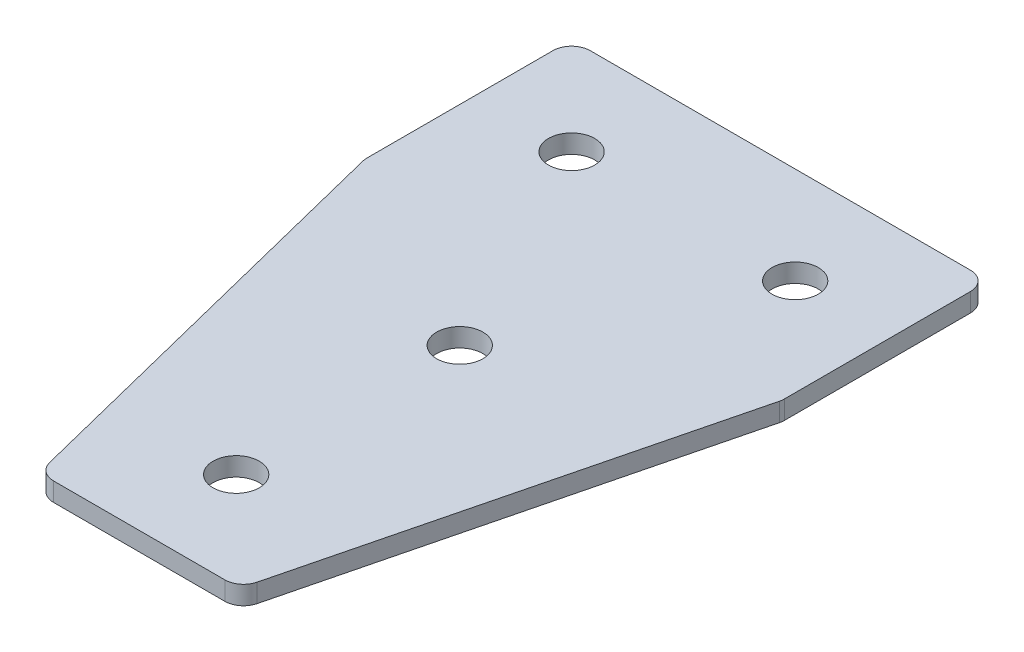
ISO-10303-21;
HEADER;
FILE_DESCRIPTION(('STEP AP214'),'2;1');
FILE_NAME('part.step','',(''),(''),'','','');
FILE_SCHEMA(('AUTOMOTIVE_DESIGN { 1 0 10303 214 1 1 1 1 }'));
ENDSEC;
DATA;
#1=APPLICATION_CONTEXT('core data for automotive mechanical design processes');
#2=APPLICATION_PROTOCOL_DEFINITION('international standard','automotive_design',2000,#1);
#3=PRODUCT_CONTEXT('',#1,'mechanical');
#4=PRODUCT('Part','Part','',(#3));
#5=PRODUCT_RELATED_PRODUCT_CATEGORY('part','',(#4));
#6=PRODUCT_DEFINITION_FORMATION('','',#4);
#7=PRODUCT_DEFINITION_CONTEXT('part definition',#1,'design');
#8=PRODUCT_DEFINITION('design','',#6,#7);
#9=PRODUCT_DEFINITION_SHAPE('','',#8);
#10=(LENGTH_UNIT() NAMED_UNIT(*) SI_UNIT(.MILLI.,.METRE.));
#11=(NAMED_UNIT(*) PLANE_ANGLE_UNIT() SI_UNIT($,.RADIAN.));
#12=(NAMED_UNIT(*) SI_UNIT($,.STERADIAN.) SOLID_ANGLE_UNIT());
#13=UNCERTAINTY_MEASURE_WITH_UNIT(LENGTH_MEASURE(1.E-05),#10,'distance_accuracy_value','');
#14=(GEOMETRIC_REPRESENTATION_CONTEXT(3) GLOBAL_UNCERTAINTY_ASSIGNED_CONTEXT((#13)) GLOBAL_UNIT_ASSIGNED_CONTEXT((#10,
#11,#12)) REPRESENTATION_CONTEXT('',''));
#15=CARTESIAN_POINT('',(0.,0.,0.));
#16=DIRECTION('',(0.,0.,1.));
#17=DIRECTION('',(1.,0.,0.));
#18=AXIS2_PLACEMENT_3D('',#15,#16,#17);
#19=CARTESIAN_POINT('',(-0.861699542383574,1.02470932668439,-31.412640110459));
#20=DIRECTION('',(0.,-1.,0.));
#21=DIRECTION('',(0.,0.,-1.));
#22=AXIS2_PLACEMENT_3D('',#19,#20,#21);
#23=PLANE('',#22);
#24=CARTESIAN_POINT('',(-0.861699542383585,1.02470932668439,-1.41264011045901));
#25=DIRECTION('',(0.,1.,0.));
#26=DIRECTION('',(0.,0.,1.));
#27=AXIS2_PLACEMENT_3D('',#24,#25,#26);
#28=CIRCLE('',#27,3.1);
#29=CARTESIAN_POINT('',(-0.861699542383585,1.02470932668439,1.68735988954099));
#30=VERTEX_POINT('',#29);
#31=EDGE_CURVE('E171',#30,#30,#28,.T.);
#32=ORIENTED_EDGE('',*,*,#31,.T.);
#33=EDGE_LOOP('',(#32));
#34=FACE_BOUND('',#33,.T.);
#35=DIRECTION('',(1.,0.,0.));
#36=VECTOR('',#35,1.);
#37=CARTESIAN_POINT('',(-13.8616995423837,1.02470932668439,41.5873598895409));
#38=LINE('',#37,#36);
#39=CARTESIAN_POINT('',(-12.3482057135638,1.02470932668439,41.5873598895409));
#40=VERTEX_POINT('',#39);
#41=CARTESIAN_POINT('',(10.6248066287967,1.02470932668439,41.5873598895409));
#42=VERTEX_POINT('',#41);
#43=EDGE_CURVE('E189',#40,#42,#38,.T.);
#44=ORIENTED_EDGE('',*,*,#43,.F.);
#45=CARTESIAN_POINT('',(-12.3482057135638,1.02470932668439,39.0873598895409));
#46=DIRECTION('',(0.,1.,0.));
#47=DIRECTION('',(0.,0.,-1.));
#48=AXIS2_PLACEMENT_3D('',#45,#46,#47);
#49=CIRCLE('',#48,2.5);
#50=CARTESIAN_POINT('',(-14.7735619639271,1.02470932668439,39.6936989521318));
#51=VERTEX_POINT('',#50);
#52=EDGE_CURVE('E155',#51,#40,#49,.T.);
#53=ORIENTED_EDGE('',*,*,#52,.F.);
#54=DIRECTION('',(-0.24253562503633,0.,-0.970142500145333));
#55=VECTOR('',#54,1.);
#56=CARTESIAN_POINT('',(-14.3001467295748,1.02470932668439,41.5873598895409));
#57=LINE('',#56,#55);
#58=CARTESIAN_POINT('',(-28.7870557927468,1.02470932668439,-16.3602763631476));
#59=VERTEX_POINT('',#58);
#60=EDGE_CURVE('E142',#51,#59,#57,.T.);
#61=ORIENTED_EDGE('',*,*,#60,.T.);
#62=CARTESIAN_POINT('',(-26.3616995423835,1.02470932668439,-16.9666154257384));
#63=DIRECTION('',(0.,1.,0.));
#64=DIRECTION('',(0.,0.,-1.));
#65=AXIS2_PLACEMENT_3D('',#62,#63,#64);
#66=CIRCLE('',#65,2.5);
#67=CARTESIAN_POINT('',(-28.8616995423835,1.02470932668439,-16.9666154257384));
#68=VERTEX_POINT('',#67);
#69=EDGE_CURVE('E153',#68,#59,#66,.T.);
#70=ORIENTED_EDGE('',*,*,#69,.F.);
#71=DIRECTION('',(0.,0.,-1.));
#72=VECTOR('',#71,1.);
#73=CARTESIAN_POINT('',(-28.8616995423835,1.02470932668439,-16.6588513616943));
#74=LINE('',#73,#72);
#75=CARTESIAN_POINT('',(-28.8616995423835,1.02470932668439,-41.912640110459));
#76=VERTEX_POINT('',#75);
#77=EDGE_CURVE('E124',#68,#76,#74,.T.);
#78=ORIENTED_EDGE('',*,*,#77,.T.);
#79=CARTESIAN_POINT('',(-26.3616995423835,1.02470932668439,-41.912640110459));
#80=DIRECTION('',(0.,1.,0.));
#81=DIRECTION('',(0.,0.,-1.));
#82=AXIS2_PLACEMENT_3D('',#79,#80,#81);
#83=CIRCLE('',#82,2.5);
#84=CARTESIAN_POINT('',(-26.3616995423835,1.02470932668439,-44.412640110459));
#85=VERTEX_POINT('',#84);
#86=EDGE_CURVE('E150',#85,#76,#83,.T.);
#87=ORIENTED_EDGE('',*,*,#86,.F.);
#88=DIRECTION('',(-1.,0.,0.));
#89=VECTOR('',#88,1.);
#90=CARTESIAN_POINT('',(27.1383004576163,1.02470932668439,-44.4126401104591));
#91=LINE('',#90,#89);
#92=CARTESIAN_POINT('',(24.6383004576163,1.02470932668439,-44.4126401104591));
#93=VERTEX_POINT('',#92);
#94=EDGE_CURVE('E186',#93,#85,#91,.T.);
#95=ORIENTED_EDGE('',*,*,#94,.F.);
#96=CARTESIAN_POINT('',(24.6383004576163,1.02470932668439,-41.9126401104591));
#97=DIRECTION('',(0.,-1.,0.));
#98=DIRECTION('',(0.,0.,-1.));
#99=AXIS2_PLACEMENT_3D('',#96,#97,#98);
#100=CIRCLE('',#99,2.5);
#101=CARTESIAN_POINT('',(27.1383004576163,1.02470932668439,-41.912640110459));
#102=VERTEX_POINT('',#101);
#103=EDGE_CURVE('E210',#93,#102,#100,.T.);
#104=ORIENTED_EDGE('',*,*,#103,.T.);
#105=DIRECTION('',(0.,0.,-1.));
#106=VECTOR('',#105,1.);
#107=CARTESIAN_POINT('',(27.1383004576163,1.02470932668439,-16.6588513616943));
#108=LINE('',#107,#106);
#109=CARTESIAN_POINT('',(27.1383004576163,1.02470932668439,-16.9666154257384));
#110=VERTEX_POINT('',#109);
#111=EDGE_CURVE('E183',#110,#102,#108,.T.);
#112=ORIENTED_EDGE('',*,*,#111,.F.);
#113=CARTESIAN_POINT('',(24.6383004576163,1.02470932668439,-16.9666154257384));
#114=DIRECTION('',(0.,-1.,0.));
#115=DIRECTION('',(0.,0.,-1.));
#116=AXIS2_PLACEMENT_3D('',#113,#114,#115);
#117=CIRCLE('',#116,2.5);
#118=CARTESIAN_POINT('',(27.0636567079796,1.02470932668439,-16.3602763631476));
#119=VERTEX_POINT('',#118);
#120=EDGE_CURVE('E31',#110,#119,#117,.T.);
#121=ORIENTED_EDGE('',*,*,#120,.T.);
#122=DIRECTION('',(0.24253562503633,0.,-0.970142500145333));
#123=VECTOR('',#122,1.);
#124=CARTESIAN_POINT('',(12.5767476448077,1.02470932668439,41.5873598895409));
#125=LINE('',#124,#123);
#126=CARTESIAN_POINT('',(13.05016287916,1.02470932668439,39.6936989521318));
#127=VERTEX_POINT('',#126);
#128=EDGE_CURVE('E191',#127,#119,#125,.T.);
#129=ORIENTED_EDGE('',*,*,#128,.F.);
#130=CARTESIAN_POINT('',(10.6248066287967,1.02470932668439,39.0873598895409));
#131=DIRECTION('',(0.,-1.,0.));
#132=DIRECTION('',(0.,0.,-1.));
#133=AXIS2_PLACEMENT_3D('',#130,#131,#132);
#134=CIRCLE('',#133,2.5);
#135=EDGE_CURVE('E213',#127,#42,#134,.T.);
#136=ORIENTED_EDGE('',*,*,#135,.T.);
#137=EDGE_LOOP('',(#44,#53,#61,#70,#78,#87,#95,#104,#112,#121,#129,#136));
#138=FACE_BOUND('',#137,.T.);
#139=CARTESIAN_POINT('',(-0.861699542383585,1.02470932668439,28.587359889541));
#140=DIRECTION('',(0.,1.,0.));
#141=DIRECTION('',(0.,0.,1.));
#142=AXIS2_PLACEMENT_3D('',#139,#140,#141);
#143=CIRCLE('',#142,3.1);
#144=CARTESIAN_POINT('',(-0.861699542383585,1.02470932668439,31.687359889541));
#145=VERTEX_POINT('',#144);
#146=EDGE_CURVE('E165',#145,#145,#143,.T.);
#147=ORIENTED_EDGE('',*,*,#146,.T.);
#148=EDGE_LOOP('',(#147));
#149=FACE_BOUND('',#148,.T.);
#150=CARTESIAN_POINT('',(14.1383004576164,1.02470932668439,-31.412640110459));
#151=DIRECTION('',(0.,1.,0.));
#152=DIRECTION('',(0.,0.,1.));
#153=AXIS2_PLACEMENT_3D('',#150,#151,#152);
#154=CIRCLE('',#153,3.1);
#155=CARTESIAN_POINT('',(14.1383004576164,1.02470932668439,-28.312640110459));
#156=VERTEX_POINT('',#155);
#157=EDGE_CURVE('E177',#156,#156,#154,.T.);
#158=ORIENTED_EDGE('',*,*,#157,.T.);
#159=EDGE_LOOP('',(#158));
#160=FACE_BOUND('',#159,.T.);
#161=CARTESIAN_POINT('',(-15.8616995423836,1.02470932668439,-31.412640110459));
#162=DIRECTION('',(0.,-1.,0.));
#163=DIRECTION('',(0.,0.,1.));
#164=AXIS2_PLACEMENT_3D('',#161,#162,#163);
#165=CIRCLE('',#164,3.1);
#166=CARTESIAN_POINT('',(-15.8616995423836,1.02470932668439,-28.312640110459));
#167=VERTEX_POINT('',#166);
#168=EDGE_CURVE('E135',#167,#167,#165,.T.);
#169=ORIENTED_EDGE('',*,*,#168,.F.);
#170=EDGE_LOOP('',(#169));
#171=FACE_BOUND('',#170,.T.);
#172=ADVANCED_FACE('F16',(#34,#138,#149,#160,#171),#23,.T.);
#173=CARTESIAN_POINT('',(27.1383004576163,1.02470932668439,-16.6588513616943));
#174=DIRECTION('',(1.,0.,0.));
#175=DIRECTION('',(0.,0.,-1.));
#176=AXIS2_PLACEMENT_3D('',#173,#174,#175);
#177=PLANE('',#176);
#178=DIRECTION('',(0.,0.,-1.));
#179=VECTOR('',#178,1.);
#180=CARTESIAN_POINT('',(27.1383004576163,3.52470932668439,-16.6588513616943));
#181=LINE('',#180,#179);
#182=CARTESIAN_POINT('',(27.1383004576163,3.52470932668439,-16.9666154257384));
#183=VERTEX_POINT('',#182);
#184=CARTESIAN_POINT('',(27.1383004576163,3.52470932668439,-41.912640110459));
#185=VERTEX_POINT('',#184);
#186=EDGE_CURVE('E180',#183,#185,#181,.T.);
#187=ORIENTED_EDGE('',*,*,#186,.F.);
#188=DIRECTION('',(0.,1.,0.));
#189=VECTOR('',#188,1.);
#190=CARTESIAN_POINT('',(27.1383004576163,1.02470932668439,-16.9666154257384));
#191=LINE('',#190,#189);
#192=EDGE_CURVE('E24',#183,#110,#191,.F.);
#193=ORIENTED_EDGE('',*,*,#192,.T.);
#194=ORIENTED_EDGE('',*,*,#111,.T.);
#195=DIRECTION('',(0.,1.,0.));
#196=VECTOR('',#195,1.);
#197=CARTESIAN_POINT('',(27.1383004576163,1.02470932668439,-41.9126401104591));
#198=LINE('',#197,#196);
#199=EDGE_CURVE('E220',#102,#185,#198,.T.);
#200=ORIENTED_EDGE('',*,*,#199,.T.);
#201=EDGE_LOOP('',(#187,#193,#194,#200));
#202=FACE_BOUND('',#201,.T.);
#203=ADVANCED_FACE('F225',(#202),#177,.T.);
#204=CARTESIAN_POINT('',(12.5767476448077,1.02470932668439,41.5873598895409));
#205=DIRECTION('',(0.970142500145333,0.,0.24253562503633));
#206=DIRECTION('',(0.24253562503633,0.,-0.970142500145333));
#207=AXIS2_PLACEMENT_3D('',#204,#205,#206);
#208=PLANE('',#207);
#209=DIRECTION('',(0.24253562503633,0.,-0.970142500145333));
#210=VECTOR('',#209,1.);
#211=CARTESIAN_POINT('',(12.5767476448077,3.52470932668439,41.5873598895409));
#212=LINE('',#211,#210);
#213=CARTESIAN_POINT('',(13.05016287916,3.52470932668439,39.6936989521318));
#214=VERTEX_POINT('',#213);
#215=CARTESIAN_POINT('',(27.0636567079796,3.52470932668439,-16.3602763631476));
#216=VERTEX_POINT('',#215);
#217=EDGE_CURVE('E187',#214,#216,#212,.T.);
#218=ORIENTED_EDGE('',*,*,#217,.F.);
#219=DIRECTION('',(0.,1.,0.));
#220=VECTOR('',#219,1.);
#221=CARTESIAN_POINT('',(13.05016287916,1.02470932668439,39.6936989521318));
#222=LINE('',#221,#220);
#223=EDGE_CURVE('E38',#214,#127,#222,.F.);
#224=ORIENTED_EDGE('',*,*,#223,.T.);
#225=ORIENTED_EDGE('',*,*,#128,.T.);
#226=DIRECTION('',(0.,1.,0.));
#227=VECTOR('',#226,1.);
#228=CARTESIAN_POINT('',(27.0636567079796,1.02470932668439,-16.3602763631476));
#229=LINE('',#228,#227);
#230=EDGE_CURVE('E216',#119,#216,#229,.T.);
#231=ORIENTED_EDGE('',*,*,#230,.T.);
#232=EDGE_LOOP('',(#218,#224,#225,#231));
#233=FACE_BOUND('',#232,.T.);
#234=ADVANCED_FACE('F233',(#233),#208,.T.);
#235=CARTESIAN_POINT('',(-13.8616995423837,1.02470932668439,41.5873598895409));
#236=DIRECTION('',(0.,0.,1.));
#237=DIRECTION('',(1.,0.,0.));
#238=AXIS2_PLACEMENT_3D('',#235,#236,#237);
#239=PLANE('',#238);
#240=DIRECTION('',(1.,0.,0.));
#241=VECTOR('',#240,1.);
#242=CARTESIAN_POINT('',(-13.8616995423837,3.52470932668439,41.5873598895409));
#243=LINE('',#242,#241);
#244=CARTESIAN_POINT('',(-12.3482057135638,3.52470932668439,41.5873598895409));
#245=VERTEX_POINT('',#244);
#246=CARTESIAN_POINT('',(10.6248066287967,3.52470932668439,41.5873598895409));
#247=VERTEX_POINT('',#246);
#248=EDGE_CURVE('E198',#245,#247,#243,.T.);
#249=ORIENTED_EDGE('',*,*,#248,.F.);
#250=DIRECTION('',(0.,1.,0.));
#251=VECTOR('',#250,1.);
#252=CARTESIAN_POINT('',(-12.3482057135638,1.02470932668439,41.5873598895409));
#253=LINE('',#252,#251);
#254=EDGE_CURVE('E147',#40,#245,#253,.T.);
#255=ORIENTED_EDGE('',*,*,#254,.F.);
#256=ORIENTED_EDGE('',*,*,#43,.T.);
#257=DIRECTION('',(0.,1.,0.));
#258=VECTOR('',#257,1.);
#259=CARTESIAN_POINT('',(10.6248066287967,1.02470932668439,41.5873598895409));
#260=LINE('',#259,#258);
#261=EDGE_CURVE('E207',#42,#247,#260,.T.);
#262=ORIENTED_EDGE('',*,*,#261,.T.);
#263=EDGE_LOOP('',(#249,#255,#256,#262));
#264=FACE_BOUND('',#263,.T.);
#265=ADVANCED_FACE('F240',(#264),#239,.T.);
#266=CARTESIAN_POINT('',(27.1383004576163,1.02470932668439,-44.4126401104591));
#267=DIRECTION('',(0.,0.,-1.));
#268=DIRECTION('',(-1.,0.,0.));
#269=AXIS2_PLACEMENT_3D('',#266,#267,#268);
#270=PLANE('',#269);
#271=ORIENTED_EDGE('',*,*,#94,.T.);
#272=DIRECTION('',(0.,1.,0.));
#273=VECTOR('',#272,1.);
#274=CARTESIAN_POINT('',(-26.3616995423835,1.02470932668439,-44.412640110459));
#275=LINE('',#274,#273);
#276=CARTESIAN_POINT('',(-26.3616995423835,3.52470932668439,-44.412640110459));
#277=VERTEX_POINT('',#276);
#278=EDGE_CURVE('E126',#277,#85,#275,.F.);
#279=ORIENTED_EDGE('',*,*,#278,.F.);
#280=DIRECTION('',(-1.,0.,0.));
#281=VECTOR('',#280,1.);
#282=CARTESIAN_POINT('',(27.1383004576163,3.52470932668439,-44.4126401104591));
#283=LINE('',#282,#281);
#284=CARTESIAN_POINT('',(24.6383004576163,3.52470932668439,-44.4126401104591));
#285=VERTEX_POINT('',#284);
#286=EDGE_CURVE('E196',#285,#277,#283,.T.);
#287=ORIENTED_EDGE('',*,*,#286,.F.);
#288=DIRECTION('',(0.,1.,0.));
#289=VECTOR('',#288,1.);
#290=CARTESIAN_POINT('',(24.6383004576163,1.02470932668439,-44.4126401104591));
#291=LINE('',#290,#289);
#292=EDGE_CURVE('E10',#285,#93,#291,.F.);
#293=ORIENTED_EDGE('',*,*,#292,.T.);
#294=EDGE_LOOP('',(#271,#279,#287,#293));
#295=FACE_BOUND('',#294,.T.);
#296=ADVANCED_FACE('F294',(#295),#270,.T.);
#297=CARTESIAN_POINT('',(-0.861699542383574,3.52470932668439,-31.412640110459));
#298=DIRECTION('',(0.,-1.,0.));
#299=DIRECTION('',(0.,0.,-1.));
#300=AXIS2_PLACEMENT_3D('',#297,#298,#299);
#301=PLANE('',#300);
#302=CARTESIAN_POINT('',(-0.861699542383585,3.52470932668439,-1.41264011045901));
#303=DIRECTION('',(0.,1.,0.));
#304=DIRECTION('',(0.,0.,1.));
#305=AXIS2_PLACEMENT_3D('',#302,#303,#304);
#306=CIRCLE('',#305,3.1);
#307=CARTESIAN_POINT('',(-0.861699542383585,3.52470932668439,1.68735988954099));
#308=VERTEX_POINT('',#307);
#309=EDGE_CURVE('E168',#308,#308,#306,.T.);
#310=ORIENTED_EDGE('',*,*,#309,.F.);
#311=EDGE_LOOP('',(#310));
#312=FACE_BOUND('',#311,.T.);
#313=CARTESIAN_POINT('',(-12.3482057135638,3.52470932668439,39.0873598895409));
#314=DIRECTION('',(0.,1.,0.));
#315=DIRECTION('',(0.,0.,-1.));
#316=AXIS2_PLACEMENT_3D('',#313,#314,#315);
#317=CIRCLE('',#316,2.5);
#318=CARTESIAN_POINT('',(-14.7735619639271,3.52470932668439,39.6936989521318));
#319=VERTEX_POINT('',#318);
#320=EDGE_CURVE('E116',#245,#319,#317,.F.);
#321=ORIENTED_EDGE('',*,*,#320,.F.);
#322=ORIENTED_EDGE('',*,*,#248,.T.);
#323=CARTESIAN_POINT('',(10.6248066287967,3.52470932668439,39.0873598895409));
#324=DIRECTION('',(0.,-1.,0.));
#325=DIRECTION('',(0.,0.,-1.));
#326=AXIS2_PLACEMENT_3D('',#323,#324,#325);
#327=CIRCLE('',#326,2.5);
#328=EDGE_CURVE('E205',#247,#214,#327,.F.);
#329=ORIENTED_EDGE('',*,*,#328,.T.);
#330=ORIENTED_EDGE('',*,*,#217,.T.);
#331=CARTESIAN_POINT('',(24.6383004576163,3.52470932668439,-16.9666154257384));
#332=DIRECTION('',(0.,-1.,0.));
#333=DIRECTION('',(0.,0.,-1.));
#334=AXIS2_PLACEMENT_3D('',#331,#332,#333);
#335=CIRCLE('',#334,2.5);
#336=EDGE_CURVE('E203',#216,#183,#335,.F.);
#337=ORIENTED_EDGE('',*,*,#336,.T.);
#338=ORIENTED_EDGE('',*,*,#186,.T.);
#339=CARTESIAN_POINT('',(24.6383004576163,3.52470932668439,-41.9126401104591));
#340=DIRECTION('',(0.,-1.,0.));
#341=DIRECTION('',(0.,0.,-1.));
#342=AXIS2_PLACEMENT_3D('',#339,#340,#341);
#343=CIRCLE('',#342,2.5);
#344=EDGE_CURVE('E193',#185,#285,#343,.F.);
#345=ORIENTED_EDGE('',*,*,#344,.T.);
#346=ORIENTED_EDGE('',*,*,#286,.T.);
#347=CARTESIAN_POINT('',(-26.3616995423835,3.52470932668439,-41.912640110459));
#348=DIRECTION('',(0.,1.,0.));
#349=DIRECTION('',(0.,0.,-1.));
#350=AXIS2_PLACEMENT_3D('',#347,#348,#349);
#351=CIRCLE('',#350,2.5);
#352=CARTESIAN_POINT('',(-28.8616995423835,3.52470932668439,-41.912640110459));
#353=VERTEX_POINT('',#352);
#354=EDGE_CURVE('E117',#353,#277,#351,.F.);
#355=ORIENTED_EDGE('',*,*,#354,.F.);
#356=DIRECTION('',(0.,0.,-1.));
#357=VECTOR('',#356,1.);
#358=CARTESIAN_POINT('',(-28.8616995423835,3.52470932668439,-16.6588513616943));
#359=LINE('',#358,#357);
#360=CARTESIAN_POINT('',(-28.8616995423835,3.52470932668439,-16.9666154257384));
#361=VERTEX_POINT('',#360);
#362=EDGE_CURVE('E122',#361,#353,#359,.T.);
#363=ORIENTED_EDGE('',*,*,#362,.F.);
#364=CARTESIAN_POINT('',(-26.3616995423835,3.52470932668439,-16.9666154257384));
#365=DIRECTION('',(0.,1.,0.));
#366=DIRECTION('',(0.,0.,-1.));
#367=AXIS2_PLACEMENT_3D('',#364,#365,#366);
#368=CIRCLE('',#367,2.5);
#369=CARTESIAN_POINT('',(-28.7870557927468,3.52470932668439,-16.3602763631476));
#370=VERTEX_POINT('',#369);
#371=EDGE_CURVE('E105',#370,#361,#368,.F.);
#372=ORIENTED_EDGE('',*,*,#371,.F.);
#373=DIRECTION('',(-0.24253562503633,0.,-0.970142500145333));
#374=VECTOR('',#373,1.);
#375=CARTESIAN_POINT('',(-14.3001467295748,3.52470932668439,41.5873598895409));
#376=LINE('',#375,#374);
#377=EDGE_CURVE('E134',#319,#370,#376,.T.);
#378=ORIENTED_EDGE('',*,*,#377,.F.);
#379=EDGE_LOOP('',(#321,#322,#329,#330,#337,#338,#345,#346,#355,#363,#372,#378));
#380=FACE_BOUND('',#379,.T.);
#381=CARTESIAN_POINT('',(-0.861699542383585,3.52470932668439,28.587359889541));
#382=DIRECTION('',(0.,1.,0.));
#383=DIRECTION('',(0.,0.,1.));
#384=AXIS2_PLACEMENT_3D('',#381,#382,#383);
#385=CIRCLE('',#384,3.1);
#386=CARTESIAN_POINT('',(-0.861699542383585,3.52470932668439,31.687359889541));
#387=VERTEX_POINT('',#386);
#388=EDGE_CURVE('E164',#387,#387,#385,.T.);
#389=ORIENTED_EDGE('',*,*,#388,.F.);
#390=EDGE_LOOP('',(#389));
#391=FACE_BOUND('',#390,.T.);
#392=CARTESIAN_POINT('',(14.1383004576164,3.52470932668439,-31.412640110459));
#393=DIRECTION('',(0.,1.,0.));
#394=DIRECTION('',(0.,0.,1.));
#395=AXIS2_PLACEMENT_3D('',#392,#393,#394);
#396=CIRCLE('',#395,3.1);
#397=CARTESIAN_POINT('',(14.1383004576164,3.52470932668439,-28.312640110459));
#398=VERTEX_POINT('',#397);
#399=EDGE_CURVE('E174',#398,#398,#396,.T.);
#400=ORIENTED_EDGE('',*,*,#399,.F.);
#401=EDGE_LOOP('',(#400));
#402=FACE_BOUND('',#401,.T.);
#403=CARTESIAN_POINT('',(-15.8616995423836,3.52470932668439,-31.412640110459));
#404=DIRECTION('',(0.,-1.,0.));
#405=DIRECTION('',(0.,0.,1.));
#406=AXIS2_PLACEMENT_3D('',#403,#404,#405);
#407=CIRCLE('',#406,3.1);
#408=CARTESIAN_POINT('',(-15.8616995423836,3.52470932668439,-28.312640110459));
#409=VERTEX_POINT('',#408);
#410=EDGE_CURVE('E139',#409,#409,#407,.T.);
#411=ORIENTED_EDGE('',*,*,#410,.T.);
#412=EDGE_LOOP('',(#411));
#413=FACE_BOUND('',#412,.T.);
#414=ADVANCED_FACE('F130',(#312,#380,#391,#402,#413),#301,.F.);
#415=CARTESIAN_POINT('',(10.6248066287967,1.02470932668439,39.0873598895409));
#416=DIRECTION('',(0.,1.,0.));
#417=DIRECTION('',(0.,0.,1.));
#418=AXIS2_PLACEMENT_3D('',#415,#416,#417);
#419=CYLINDRICAL_SURFACE('',#418,2.5);
#420=ORIENTED_EDGE('',*,*,#135,.F.);
#421=ORIENTED_EDGE('',*,*,#223,.F.);
#422=ORIENTED_EDGE('',*,*,#328,.F.);
#423=ORIENTED_EDGE('',*,*,#261,.F.);
#424=EDGE_LOOP('',(#420,#421,#422,#423));
#425=FACE_BOUND('',#424,.T.);
#426=ADVANCED_FACE('F238',(#425),#419,.T.);
#427=CARTESIAN_POINT('',(24.6383004576163,1.02470932668439,-16.9666154257384));
#428=DIRECTION('',(0.,1.,0.));
#429=DIRECTION('',(0.,0.,1.));
#430=AXIS2_PLACEMENT_3D('',#427,#428,#429);
#431=CYLINDRICAL_SURFACE('',#430,2.5);
#432=ORIENTED_EDGE('',*,*,#120,.F.);
#433=ORIENTED_EDGE('',*,*,#192,.F.);
#434=ORIENTED_EDGE('',*,*,#336,.F.);
#435=ORIENTED_EDGE('',*,*,#230,.F.);
#436=EDGE_LOOP('',(#432,#433,#434,#435));
#437=FACE_BOUND('',#436,.T.);
#438=ADVANCED_FACE('F232',(#437),#431,.T.);
#439=CARTESIAN_POINT('',(24.6383004576163,1.02470932668439,-41.9126401104591));
#440=DIRECTION('',(0.,1.,0.));
#441=DIRECTION('',(0.,0.,1.));
#442=AXIS2_PLACEMENT_3D('',#439,#440,#441);
#443=CYLINDRICAL_SURFACE('',#442,2.5);
#444=ORIENTED_EDGE('',*,*,#103,.F.);
#445=ORIENTED_EDGE('',*,*,#292,.F.);
#446=ORIENTED_EDGE('',*,*,#344,.F.);
#447=ORIENTED_EDGE('',*,*,#199,.F.);
#448=EDGE_LOOP('',(#444,#445,#446,#447));
#449=FACE_BOUND('',#448,.T.);
#450=ADVANCED_FACE('F18',(#449),#443,.T.);
#451=CARTESIAN_POINT('',(14.1383004576164,1.02470932668439,-31.412640110459));
#452=DIRECTION('',(0.,1.,0.));
#453=DIRECTION('',(0.,0.,1.));
#454=AXIS2_PLACEMENT_3D('',#451,#452,#453);
#455=CYLINDRICAL_SURFACE('',#454,3.1);
#456=ORIENTED_EDGE('',*,*,#157,.F.);
#457=EDGE_LOOP('',(#456));
#458=FACE_BOUND('',#457,.T.);
#459=ORIENTED_EDGE('',*,*,#399,.T.);
#460=EDGE_LOOP('',(#459));
#461=FACE_BOUND('',#460,.T.);
#462=ADVANCED_FACE('F282',(#458,#461),#455,.F.);
#463=CARTESIAN_POINT('',(-0.861699542383585,1.02470932668439,-1.41264011045901));
#464=DIRECTION('',(0.,1.,0.));
#465=DIRECTION('',(0.,0.,1.));
#466=AXIS2_PLACEMENT_3D('',#463,#464,#465);
#467=CYLINDRICAL_SURFACE('',#466,3.1);
#468=ORIENTED_EDGE('',*,*,#31,.F.);
#469=EDGE_LOOP('',(#468));
#470=FACE_BOUND('',#469,.T.);
#471=ORIENTED_EDGE('',*,*,#309,.T.);
#472=EDGE_LOOP('',(#471));
#473=FACE_BOUND('',#472,.T.);
#474=ADVANCED_FACE('F287',(#470,#473),#467,.F.);
#475=CARTESIAN_POINT('',(-0.861699542383585,1.02470932668439,28.587359889541));
#476=DIRECTION('',(0.,1.,0.));
#477=DIRECTION('',(0.,0.,1.));
#478=AXIS2_PLACEMENT_3D('',#475,#476,#477);
#479=CYLINDRICAL_SURFACE('',#478,3.1);
#480=ORIENTED_EDGE('',*,*,#388,.T.);
#481=EDGE_LOOP('',(#480));
#482=FACE_BOUND('',#481,.T.);
#483=ORIENTED_EDGE('',*,*,#146,.F.);
#484=EDGE_LOOP('',(#483));
#485=FACE_BOUND('',#484,.T.);
#486=ADVANCED_FACE('F308',(#482,#485),#479,.F.);
#487=CARTESIAN_POINT('',(-28.8616995423835,1.02470932668439,-16.6588513616943));
#488=DIRECTION('',(-1.,0.,0.));
#489=DIRECTION('',(0.,0.,-1.));
#490=AXIS2_PLACEMENT_3D('',#487,#488,#489);
#491=PLANE('',#490);
#492=ORIENTED_EDGE('',*,*,#362,.T.);
#493=DIRECTION('',(0.,1.,0.));
#494=VECTOR('',#493,1.);
#495=CARTESIAN_POINT('',(-28.8616995423835,1.02470932668439,-41.912640110459));
#496=LINE('',#495,#494);
#497=EDGE_CURVE('E127',#76,#353,#496,.T.);
#498=ORIENTED_EDGE('',*,*,#497,.F.);
#499=ORIENTED_EDGE('',*,*,#77,.F.);
#500=DIRECTION('',(0.,1.,0.));
#501=VECTOR('',#500,1.);
#502=CARTESIAN_POINT('',(-28.8616995423835,1.02470932668439,-16.9666154257384));
#503=LINE('',#502,#501);
#504=EDGE_CURVE('E109',#361,#68,#503,.F.);
#505=ORIENTED_EDGE('',*,*,#504,.F.);
#506=EDGE_LOOP('',(#492,#498,#499,#505));
#507=FACE_BOUND('',#506,.T.);
#508=ADVANCED_FACE('F121',(#507),#491,.T.);
#509=CARTESIAN_POINT('',(-14.3001467295748,1.02470932668439,41.5873598895409));
#510=DIRECTION('',(-0.970142500145333,0.,0.24253562503633));
#511=DIRECTION('',(-0.24253562503633,0.,-0.970142500145333));
#512=AXIS2_PLACEMENT_3D('',#509,#510,#511);
#513=PLANE('',#512);
#514=ORIENTED_EDGE('',*,*,#377,.T.);
#515=DIRECTION('',(0.,1.,0.));
#516=VECTOR('',#515,1.);
#517=CARTESIAN_POINT('',(-28.7870557927468,1.02470932668439,-16.3602763631476));
#518=LINE('',#517,#516);
#519=EDGE_CURVE('E111',#59,#370,#518,.T.);
#520=ORIENTED_EDGE('',*,*,#519,.F.);
#521=ORIENTED_EDGE('',*,*,#60,.F.);
#522=DIRECTION('',(0.,1.,0.));
#523=VECTOR('',#522,1.);
#524=CARTESIAN_POINT('',(-14.7735619639271,1.02470932668439,39.6936989521318));
#525=LINE('',#524,#523);
#526=EDGE_CURVE('E159',#319,#51,#525,.F.);
#527=ORIENTED_EDGE('',*,*,#526,.F.);
#528=EDGE_LOOP('',(#514,#520,#521,#527));
#529=FACE_BOUND('',#528,.T.);
#530=ADVANCED_FACE('F249',(#529),#513,.T.);
#531=CARTESIAN_POINT('',(-12.3482057135638,1.02470932668439,39.0873598895409));
#532=DIRECTION('',(0.,1.,0.));
#533=DIRECTION('',(0.,0.,1.));
#534=AXIS2_PLACEMENT_3D('',#531,#532,#533);
#535=CYLINDRICAL_SURFACE('',#534,2.5);
#536=ORIENTED_EDGE('',*,*,#52,.T.);
#537=ORIENTED_EDGE('',*,*,#254,.T.);
#538=ORIENTED_EDGE('',*,*,#320,.T.);
#539=ORIENTED_EDGE('',*,*,#526,.T.);
#540=EDGE_LOOP('',(#536,#537,#538,#539));
#541=FACE_BOUND('',#540,.T.);
#542=ADVANCED_FACE('F246',(#541),#535,.T.);
#543=CARTESIAN_POINT('',(-26.3616995423835,1.02470932668439,-16.9666154257384));
#544=DIRECTION('',(0.,1.,0.));
#545=DIRECTION('',(0.,0.,1.));
#546=AXIS2_PLACEMENT_3D('',#543,#544,#545);
#547=CYLINDRICAL_SURFACE('',#546,2.5);
#548=ORIENTED_EDGE('',*,*,#69,.T.);
#549=ORIENTED_EDGE('',*,*,#519,.T.);
#550=ORIENTED_EDGE('',*,*,#371,.T.);
#551=ORIENTED_EDGE('',*,*,#504,.T.);
#552=EDGE_LOOP('',(#548,#549,#550,#551));
#553=FACE_BOUND('',#552,.T.);
#554=ADVANCED_FACE('F108',(#553),#547,.T.);
#555=CARTESIAN_POINT('',(-26.3616995423835,1.02470932668439,-41.912640110459));
#556=DIRECTION('',(0.,1.,0.));
#557=DIRECTION('',(0.,0.,1.));
#558=AXIS2_PLACEMENT_3D('',#555,#556,#557);
#559=CYLINDRICAL_SURFACE('',#558,2.5);
#560=ORIENTED_EDGE('',*,*,#86,.T.);
#561=ORIENTED_EDGE('',*,*,#497,.T.);
#562=ORIENTED_EDGE('',*,*,#354,.T.);
#563=ORIENTED_EDGE('',*,*,#278,.T.);
#564=EDGE_LOOP('',(#560,#561,#562,#563));
#565=FACE_BOUND('',#564,.T.);
#566=ADVANCED_FACE('F258',(#565),#559,.T.);
#567=CARTESIAN_POINT('',(-15.8616995423836,1.02470932668439,-31.412640110459));
#568=DIRECTION('',(0.,1.,0.));
#569=DIRECTION('',(0.,0.,1.));
#570=AXIS2_PLACEMENT_3D('',#567,#568,#569);
#571=CYLINDRICAL_SURFACE('',#570,3.1);
#572=ORIENTED_EDGE('',*,*,#168,.T.);
#573=EDGE_LOOP('',(#572));
#574=FACE_BOUND('',#573,.T.);
#575=ORIENTED_EDGE('',*,*,#410,.F.);
#576=EDGE_LOOP('',(#575));
#577=FACE_BOUND('',#576,.T.);
#578=ADVANCED_FACE('F256',(#574,#577),#571,.F.);
#579=CLOSED_SHELL('',(#172,#203,#234,#265,#296,#414,#426,#438,#450,#462,#474,#486,#508,#530,
#542,#554,#566,#578));
#580=MANIFOLD_SOLID_BREP('B1',#579);
#581=ADVANCED_BREP_SHAPE_REPRESENTATION('',(#18,#580),#14);
#582=SHAPE_DEFINITION_REPRESENTATION(#9,#581);
ENDSEC;
END-ISO-10303-21;
